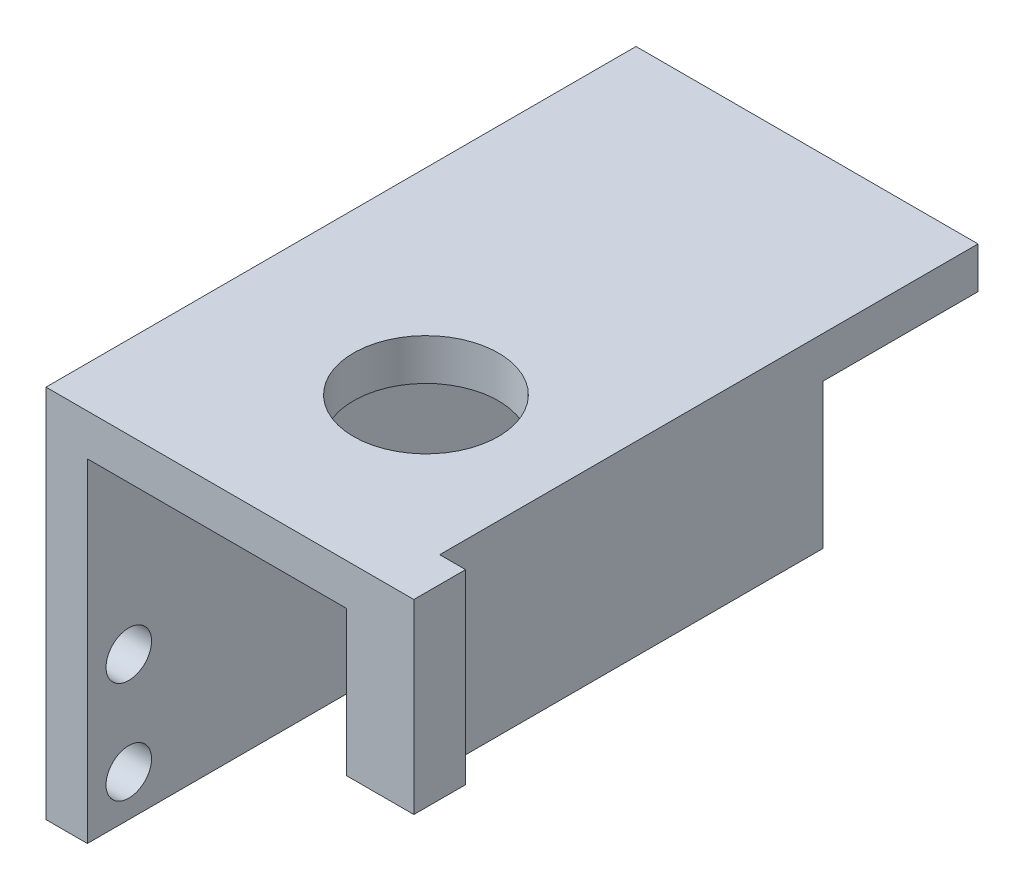
ISO-10303-21;
HEADER;
FILE_DESCRIPTION(('STEP AP214'),'2;1');
FILE_NAME('part.step','',(''),(''),'','','');
FILE_SCHEMA(('AUTOMOTIVE_DESIGN { 1 0 10303 214 1 1 1 1 }'));
ENDSEC;
DATA;
#1=APPLICATION_CONTEXT('core data for automotive mechanical design processes');
#2=APPLICATION_PROTOCOL_DEFINITION('international standard','automotive_design',2000,#1);
#3=PRODUCT_CONTEXT('',#1,'mechanical');
#4=PRODUCT('Part','Part','',(#3));
#5=PRODUCT_RELATED_PRODUCT_CATEGORY('part','',(#4));
#6=PRODUCT_DEFINITION_FORMATION('','',#4);
#7=PRODUCT_DEFINITION_CONTEXT('part definition',#1,'design');
#8=PRODUCT_DEFINITION('design','',#6,#7);
#9=PRODUCT_DEFINITION_SHAPE('','',#8);
#10=(LENGTH_UNIT() NAMED_UNIT(*) SI_UNIT(.MILLI.,.METRE.));
#11=(NAMED_UNIT(*) PLANE_ANGLE_UNIT() SI_UNIT($,.RADIAN.));
#12=(NAMED_UNIT(*) SI_UNIT($,.STERADIAN.) SOLID_ANGLE_UNIT());
#13=UNCERTAINTY_MEASURE_WITH_UNIT(LENGTH_MEASURE(1.E-05),#10,'distance_accuracy_value','');
#14=(GEOMETRIC_REPRESENTATION_CONTEXT(3) GLOBAL_UNCERTAINTY_ASSIGNED_CONTEXT((#13)) GLOBAL_UNIT_ASSIGNED_CONTEXT((#10,
#11,#12)) REPRESENTATION_CONTEXT('',''));
#15=CARTESIAN_POINT('',(0.,0.,0.));
#16=DIRECTION('',(0.,0.,1.));
#17=DIRECTION('',(1.,0.,0.));
#18=AXIS2_PLACEMENT_3D('',#15,#16,#17);
#19=CARTESIAN_POINT('',(33.05,14.1,28.51));
#20=DIRECTION('',(0.,1.,0.));
#21=DIRECTION('',(0.,0.,1.));
#22=AXIS2_PLACEMENT_3D('',#19,#20,#21);
#23=PLANE('',#22);
#24=CARTESIAN_POINT('',(19.,14.1,10.79));
#25=DIRECTION('',(0.,1.,0.));
#26=DIRECTION('',(0.,0.,1.));
#27=AXIS2_PLACEMENT_3D('',#24,#25,#26);
#28=CIRCLE('',#27,7.);
#29=CARTESIAN_POINT('',(19.,14.1,17.79));
#30=VERTEX_POINT('',#29);
#31=EDGE_CURVE('E172',#30,#30,#28,.F.);
#32=ORIENTED_EDGE('',*,*,#31,.F.);
#33=EDGE_LOOP('',(#32));
#34=FACE_BOUND('',#33,.T.);
#35=DIRECTION('',(0.,0.,-1.));
#36=VECTOR('',#35,1.);
#37=CARTESIAN_POINT('',(29.05,14.1,28.51));
#38=LINE('',#37,#36);
#39=CARTESIAN_POINT('',(29.05,14.1,28.51));
#40=VERTEX_POINT('',#39);
#41=CARTESIAN_POINT('',(29.05,14.1,-13.51));
#42=VERTEX_POINT('',#41);
#43=EDGE_CURVE('E176',#40,#42,#38,.T.);
#44=ORIENTED_EDGE('',*,*,#43,.F.);
#45=DIRECTION('',(-1.,0.,0.));
#46=VECTOR('',#45,1.);
#47=CARTESIAN_POINT('',(33.05,14.1,28.51));
#48=LINE('',#47,#46);
#49=CARTESIAN_POINT('',(4.,14.1,28.51));
#50=VERTEX_POINT('',#49);
#51=EDGE_CURVE('E215',#40,#50,#48,.T.);
#52=ORIENTED_EDGE('',*,*,#51,.T.);
#53=DIRECTION('',(0.,0.,-1.));
#54=VECTOR('',#53,1.);
#55=CARTESIAN_POINT('',(4.,14.1,28.51));
#56=LINE('',#55,#54);
#57=CARTESIAN_POINT('',(4.,14.1,-28.51));
#58=VERTEX_POINT('',#57);
#59=EDGE_CURVE('E197',#50,#58,#56,.T.);
#60=ORIENTED_EDGE('',*,*,#59,.T.);
#61=DIRECTION('',(-1.,0.,0.));
#62=VECTOR('',#61,1.);
#63=CARTESIAN_POINT('',(33.05,14.1,-28.51));
#64=LINE('',#63,#62);
#65=CARTESIAN_POINT('',(33.05,14.1,-28.51));
#66=VERTEX_POINT('',#65);
#67=EDGE_CURVE('E208',#66,#58,#64,.T.);
#68=ORIENTED_EDGE('',*,*,#67,.F.);
#69=DIRECTION('',(0.,0.,-1.));
#70=VECTOR('',#69,1.);
#71=CARTESIAN_POINT('',(33.05,14.1,28.51));
#72=LINE('',#71,#70);
#73=CARTESIAN_POINT('',(33.05,14.1,-13.51));
#74=VERTEX_POINT('',#73);
#75=EDGE_CURVE('E198',#74,#66,#72,.T.);
#76=ORIENTED_EDGE('',*,*,#75,.F.);
#77=DIRECTION('',(1.,0.,0.));
#78=VECTOR('',#77,1.);
#79=CARTESIAN_POINT('',(33.05,14.1,-13.51));
#80=LINE('',#79,#78);
#81=EDGE_CURVE('E178',#42,#74,#80,.T.);
#82=ORIENTED_EDGE('',*,*,#81,.F.);
#83=EDGE_LOOP('',(#44,#52,#60,#68,#76,#82));
#84=FACE_BOUND('',#83,.T.);
#85=ADVANCED_FACE('F41',(#34,#84),#23,.F.);
#86=CARTESIAN_POINT('',(4.,0.,0.));
#87=DIRECTION('',(1.,0.,0.));
#88=DIRECTION('',(0.,0.,-1.));
#89=AXIS2_PLACEMENT_3D('',#86,#87,#88);
#90=PLANE('',#89);
#91=ORIENTED_EDGE('',*,*,#59,.F.);
#92=DIRECTION('',(0.,-1.,0.));
#93=VECTOR('',#92,1.);
#94=CARTESIAN_POINT('',(4.,18.1,28.51));
#95=LINE('',#94,#93);
#96=CARTESIAN_POINT('',(4.,-18.1,28.51));
#97=VERTEX_POINT('',#96);
#98=EDGE_CURVE('E254',#50,#97,#95,.T.);
#99=ORIENTED_EDGE('',*,*,#98,.T.);
#100=DIRECTION('',(0.,0.,-1.));
#101=VECTOR('',#100,1.);
#102=CARTESIAN_POINT('',(4.,-18.1,28.51));
#103=LINE('',#102,#101);
#104=CARTESIAN_POINT('',(4.,-18.1,-28.51));
#105=VERTEX_POINT('',#104);
#106=EDGE_CURVE('E258',#97,#105,#103,.T.);
#107=ORIENTED_EDGE('',*,*,#106,.T.);
#108=DIRECTION('',(0.,1.,0.));
#109=VECTOR('',#108,1.);
#110=CARTESIAN_POINT('',(4.,18.1,-28.51));
#111=LINE('',#110,#109);
#112=EDGE_CURVE('E251',#105,#58,#111,.T.);
#113=ORIENTED_EDGE('',*,*,#112,.T.);
#114=EDGE_LOOP('',(#91,#99,#107,#113));
#115=FACE_BOUND('',#114,.T.);
#116=CARTESIAN_POINT('',(4.,-4.25,-24.51));
#117=DIRECTION('',(1.,0.,0.));
#118=DIRECTION('',(0.,0.,-1.));
#119=AXIS2_PLACEMENT_3D('',#116,#117,#118);
#120=CIRCLE('',#119,2.2);
#121=CARTESIAN_POINT('',(4.,-4.25,-26.71));
#122=VERTEX_POINT('',#121);
#123=EDGE_CURVE('E227',#122,#122,#120,.T.);
#124=ORIENTED_EDGE('',*,*,#123,.F.);
#125=EDGE_LOOP('',(#124));
#126=FACE_BOUND('',#125,.T.);
#127=CARTESIAN_POINT('',(4.,-4.25,24.51));
#128=DIRECTION('',(1.,0.,0.));
#129=DIRECTION('',(0.,0.,-1.));
#130=AXIS2_PLACEMENT_3D('',#127,#128,#129);
#131=CIRCLE('',#130,2.2);
#132=CARTESIAN_POINT('',(4.,-4.25,22.31));
#133=VERTEX_POINT('',#132);
#134=EDGE_CURVE('E243',#133,#133,#131,.T.);
#135=ORIENTED_EDGE('',*,*,#134,.F.);
#136=EDGE_LOOP('',(#135));
#137=FACE_BOUND('',#136,.T.);
#138=CARTESIAN_POINT('',(4.,-14.1,24.51));
#139=DIRECTION('',(1.,0.,0.));
#140=DIRECTION('',(0.,0.,-1.));
#141=AXIS2_PLACEMENT_3D('',#138,#139,#140);
#142=CIRCLE('',#141,2.2);
#143=CARTESIAN_POINT('',(4.,-14.1,22.31));
#144=VERTEX_POINT('',#143);
#145=EDGE_CURVE('E235',#144,#144,#142,.T.);
#146=ORIENTED_EDGE('',*,*,#145,.F.);
#147=EDGE_LOOP('',(#146));
#148=FACE_BOUND('',#147,.T.);
#149=CARTESIAN_POINT('',(4.,-14.1,-24.51));
#150=DIRECTION('',(1.,0.,0.));
#151=DIRECTION('',(0.,0.,-1.));
#152=AXIS2_PLACEMENT_3D('',#149,#150,#151);
#153=CIRCLE('',#152,2.2);
#154=CARTESIAN_POINT('',(4.,-14.1,-26.71));
#155=VERTEX_POINT('',#154);
#156=EDGE_CURVE('E219',#155,#155,#153,.T.);
#157=ORIENTED_EDGE('',*,*,#156,.F.);
#158=EDGE_LOOP('',(#157));
#159=FACE_BOUND('',#158,.T.);
#160=ADVANCED_FACE('F298',(#115,#126,#137,#148,#159),#90,.T.);
#161=CARTESIAN_POINT('',(0.,0.,0.));
#162=DIRECTION('',(1.,0.,0.));
#163=DIRECTION('',(0.,0.,-1.));
#164=AXIS2_PLACEMENT_3D('',#161,#162,#163);
#165=PLANE('',#164);
#166=DIRECTION('',(0.,1.,0.));
#167=VECTOR('',#166,1.);
#168=CARTESIAN_POINT('',(0.,18.1,-28.51));
#169=LINE('',#168,#167);
#170=CARTESIAN_POINT('',(0.,-18.1,-28.51));
#171=VERTEX_POINT('',#170);
#172=CARTESIAN_POINT('',(0.,18.1,-28.51));
#173=VERTEX_POINT('',#172);
#174=EDGE_CURVE('E247',#171,#173,#169,.T.);
#175=ORIENTED_EDGE('',*,*,#174,.F.);
#176=DIRECTION('',(0.,0.,-1.));
#177=VECTOR('',#176,1.);
#178=CARTESIAN_POINT('',(0.,-18.1,28.51));
#179=LINE('',#178,#177);
#180=CARTESIAN_POINT('',(0.,-18.1,28.51));
#181=VERTEX_POINT('',#180);
#182=EDGE_CURVE('E255',#181,#171,#179,.T.);
#183=ORIENTED_EDGE('',*,*,#182,.F.);
#184=DIRECTION('',(0.,-1.,0.));
#185=VECTOR('',#184,1.);
#186=CARTESIAN_POINT('',(0.,18.1,28.51));
#187=LINE('',#186,#185);
#188=CARTESIAN_POINT('',(0.,18.1,28.51));
#189=VERTEX_POINT('',#188);
#190=EDGE_CURVE('E268',#189,#181,#187,.T.);
#191=ORIENTED_EDGE('',*,*,#190,.F.);
#192=DIRECTION('',(0.,0.,1.));
#193=VECTOR('',#192,1.);
#194=CARTESIAN_POINT('',(0.,18.1,28.51));
#195=LINE('',#194,#193);
#196=EDGE_CURVE('E265',#173,#189,#195,.T.);
#197=ORIENTED_EDGE('',*,*,#196,.F.);
#198=EDGE_LOOP('',(#175,#183,#191,#197));
#199=FACE_BOUND('',#198,.T.);
#200=CARTESIAN_POINT('',(0.,-4.25,24.51));
#201=DIRECTION('',(1.,0.,0.));
#202=DIRECTION('',(0.,0.,-1.));
#203=AXIS2_PLACEMENT_3D('',#200,#201,#202);
#204=CIRCLE('',#203,2.2);
#205=CARTESIAN_POINT('',(0.,-4.25,22.31));
#206=VERTEX_POINT('',#205);
#207=EDGE_CURVE('E239',#206,#206,#204,.T.);
#208=ORIENTED_EDGE('',*,*,#207,.T.);
#209=EDGE_LOOP('',(#208));
#210=FACE_BOUND('',#209,.T.);
#211=CARTESIAN_POINT('',(0.,-14.1,24.51));
#212=DIRECTION('',(1.,0.,0.));
#213=DIRECTION('',(0.,0.,-1.));
#214=AXIS2_PLACEMENT_3D('',#211,#212,#213);
#215=CIRCLE('',#214,2.2);
#216=CARTESIAN_POINT('',(0.,-14.1,22.31));
#217=VERTEX_POINT('',#216);
#218=EDGE_CURVE('E231',#217,#217,#215,.T.);
#219=ORIENTED_EDGE('',*,*,#218,.T.);
#220=EDGE_LOOP('',(#219));
#221=FACE_BOUND('',#220,.T.);
#222=CARTESIAN_POINT('',(0.,-4.25,-24.51));
#223=DIRECTION('',(1.,0.,0.));
#224=DIRECTION('',(0.,0.,-1.));
#225=AXIS2_PLACEMENT_3D('',#222,#223,#224);
#226=CIRCLE('',#225,2.2);
#227=CARTESIAN_POINT('',(0.,-4.25,-26.71));
#228=VERTEX_POINT('',#227);
#229=EDGE_CURVE('E223',#228,#228,#226,.T.);
#230=ORIENTED_EDGE('',*,*,#229,.T.);
#231=EDGE_LOOP('',(#230));
#232=FACE_BOUND('',#231,.T.);
#233=CARTESIAN_POINT('',(0.,-14.1,-24.51));
#234=DIRECTION('',(1.,0.,0.));
#235=DIRECTION('',(0.,0.,-1.));
#236=AXIS2_PLACEMENT_3D('',#233,#234,#235);
#237=CIRCLE('',#236,2.2);
#238=CARTESIAN_POINT('',(0.,-14.1,-26.71));
#239=VERTEX_POINT('',#238);
#240=EDGE_CURVE('E218',#239,#239,#237,.T.);
#241=ORIENTED_EDGE('',*,*,#240,.T.);
#242=EDGE_LOOP('',(#241));
#243=FACE_BOUND('',#242,.T.);
#244=ADVANCED_FACE('F286',(#199,#210,#221,#232,#243),#165,.F.);
#245=CARTESIAN_POINT('',(4.,18.1,-28.51));
#246=DIRECTION('',(0.,0.,1.));
#247=DIRECTION('',(1.,0.,0.));
#248=AXIS2_PLACEMENT_3D('',#245,#246,#247);
#249=PLANE('',#248);
#250=ORIENTED_EDGE('',*,*,#174,.T.);
#251=DIRECTION('',(-1.,0.,0.));
#252=VECTOR('',#251,1.);
#253=CARTESIAN_POINT('',(4.,18.1,-28.51));
#254=LINE('',#253,#252);
#255=CARTESIAN_POINT('',(33.05,18.1,-28.51));
#256=VERTEX_POINT('',#255);
#257=EDGE_CURVE('E11',#256,#173,#254,.T.);
#258=ORIENTED_EDGE('',*,*,#257,.F.);
#259=DIRECTION('',(0.,1.,0.));
#260=VECTOR('',#259,1.);
#261=CARTESIAN_POINT('',(33.05,18.1,-28.51));
#262=LINE('',#261,#260);
#263=EDGE_CURVE('E201',#66,#256,#262,.T.);
#264=ORIENTED_EDGE('',*,*,#263,.F.);
#265=ORIENTED_EDGE('',*,*,#67,.T.);
#266=ORIENTED_EDGE('',*,*,#112,.F.);
#267=DIRECTION('',(-1.,0.,0.));
#268=VECTOR('',#267,1.);
#269=CARTESIAN_POINT('',(4.,-18.1,-28.51));
#270=LINE('',#269,#268);
#271=EDGE_CURVE('E261',#105,#171,#270,.T.);
#272=ORIENTED_EDGE('',*,*,#271,.T.);
#273=EDGE_LOOP('',(#250,#258,#264,#265,#266,#272));
#274=FACE_BOUND('',#273,.T.);
#275=ADVANCED_FACE('F43',(#274),#249,.F.);
#276=CARTESIAN_POINT('',(4.,18.1,28.51));
#277=DIRECTION('',(0.,-1.,0.));
#278=DIRECTION('',(0.,0.,-1.));
#279=AXIS2_PLACEMENT_3D('',#276,#277,#278);
#280=PLANE('',#279);
#281=CARTESIAN_POINT('',(19.,18.1,10.79));
#282=DIRECTION('',(0.,1.,0.));
#283=DIRECTION('',(0.,0.,1.));
#284=AXIS2_PLACEMENT_3D('',#281,#282,#283);
#285=CIRCLE('',#284,7.);
#286=CARTESIAN_POINT('',(19.,18.1,17.79));
#287=VERTEX_POINT('',#286);
#288=EDGE_CURVE('E168',#287,#287,#285,.T.);
#289=ORIENTED_EDGE('',*,*,#288,.F.);
#290=EDGE_LOOP('',(#289));
#291=FACE_BOUND('',#290,.T.);
#292=ORIENTED_EDGE('',*,*,#196,.T.);
#293=DIRECTION('',(-1.,0.,0.));
#294=VECTOR('',#293,1.);
#295=CARTESIAN_POINT('',(4.,18.1,28.51));
#296=LINE('',#295,#294);
#297=CARTESIAN_POINT('',(35.55,18.1,28.51));
#298=VERTEX_POINT('',#297);
#299=EDGE_CURVE('E50',#298,#189,#296,.T.);
#300=ORIENTED_EDGE('',*,*,#299,.F.);
#301=DIRECTION('',(0.,0.,1.));
#302=VECTOR('',#301,1.);
#303=CARTESIAN_POINT('',(35.55,18.1,28.51));
#304=LINE('',#303,#302);
#305=CARTESIAN_POINT('',(35.55,18.1,23.51));
#306=VERTEX_POINT('',#305);
#307=EDGE_CURVE('E152',#306,#298,#304,.T.);
#308=ORIENTED_EDGE('',*,*,#307,.F.);
#309=DIRECTION('',(-1.,0.,0.));
#310=VECTOR('',#309,1.);
#311=CARTESIAN_POINT('',(35.55,18.1,23.51));
#312=LINE('',#311,#310);
#313=CARTESIAN_POINT('',(33.05,18.1,23.51));
#314=VERTEX_POINT('',#313);
#315=EDGE_CURVE('E161',#306,#314,#312,.T.);
#316=ORIENTED_EDGE('',*,*,#315,.T.);
#317=DIRECTION('',(0.,0.,1.));
#318=VECTOR('',#317,1.);
#319=CARTESIAN_POINT('',(33.05,18.1,28.51));
#320=LINE('',#319,#318);
#321=EDGE_CURVE('E205',#256,#314,#320,.T.);
#322=ORIENTED_EDGE('',*,*,#321,.F.);
#323=ORIENTED_EDGE('',*,*,#257,.T.);
#324=EDGE_LOOP('',(#292,#300,#308,#316,#322,#323));
#325=FACE_BOUND('',#324,.T.);
#326=ADVANCED_FACE('F315',(#291,#325),#280,.F.);
#327=CARTESIAN_POINT('',(4.,18.1,28.51));
#328=DIRECTION('',(0.,0.,-1.));
#329=DIRECTION('',(0.,1.,0.));
#330=AXIS2_PLACEMENT_3D('',#327,#328,#329);
#331=PLANE('',#330);
#332=ORIENTED_EDGE('',*,*,#190,.T.);
#333=DIRECTION('',(-1.,0.,0.));
#334=VECTOR('',#333,1.);
#335=CARTESIAN_POINT('',(4.,-18.1,28.51));
#336=LINE('',#335,#334);
#337=EDGE_CURVE('E276',#97,#181,#336,.T.);
#338=ORIENTED_EDGE('',*,*,#337,.F.);
#339=ORIENTED_EDGE('',*,*,#98,.F.);
#340=ORIENTED_EDGE('',*,*,#51,.F.);
#341=DIRECTION('',(0.,1.,0.));
#342=VECTOR('',#341,1.);
#343=CARTESIAN_POINT('',(29.05,0.100000000000001,28.51));
#344=LINE('',#343,#342);
#345=CARTESIAN_POINT('',(29.05,0.100000000000001,28.51));
#346=VERTEX_POINT('',#345);
#347=EDGE_CURVE('E132',#346,#40,#344,.T.);
#348=ORIENTED_EDGE('',*,*,#347,.F.);
#349=DIRECTION('',(-1.,0.,0.));
#350=VECTOR('',#349,1.);
#351=CARTESIAN_POINT('',(33.05,0.100000000000001,28.51));
#352=LINE('',#351,#350);
#353=CARTESIAN_POINT('',(35.55,0.100000000000001,28.51));
#354=VERTEX_POINT('',#353);
#355=EDGE_CURVE('E125',#354,#346,#352,.T.);
#356=ORIENTED_EDGE('',*,*,#355,.F.);
#357=DIRECTION('',(0.,-1.,0.));
#358=VECTOR('',#357,1.);
#359=CARTESIAN_POINT('',(35.55,18.1,28.51));
#360=LINE('',#359,#358);
#361=EDGE_CURVE('E130',#298,#354,#360,.T.);
#362=ORIENTED_EDGE('',*,*,#361,.F.);
#363=ORIENTED_EDGE('',*,*,#299,.T.);
#364=EDGE_LOOP('',(#332,#338,#339,#340,#348,#356,#362,#363));
#365=FACE_BOUND('',#364,.T.);
#366=ADVANCED_FACE('F127',(#365),#331,.F.);
#367=CARTESIAN_POINT('',(4.,-18.1,28.51));
#368=DIRECTION('',(0.,1.,0.));
#369=DIRECTION('',(0.,0.,1.));
#370=AXIS2_PLACEMENT_3D('',#367,#368,#369);
#371=PLANE('',#370);
#372=ORIENTED_EDGE('',*,*,#182,.T.);
#373=ORIENTED_EDGE('',*,*,#271,.F.);
#374=ORIENTED_EDGE('',*,*,#106,.F.);
#375=ORIENTED_EDGE('',*,*,#337,.T.);
#376=EDGE_LOOP('',(#372,#373,#374,#375));
#377=FACE_BOUND('',#376,.T.);
#378=ADVANCED_FACE('F290',(#377),#371,.F.);
#379=CARTESIAN_POINT('',(4.,-4.25,24.51));
#380=DIRECTION('',(-1.,0.,0.));
#381=DIRECTION('',(0.,0.,1.));
#382=AXIS2_PLACEMENT_3D('',#379,#380,#381);
#383=CYLINDRICAL_SURFACE('',#382,2.2);
#384=ORIENTED_EDGE('',*,*,#134,.T.);
#385=EDGE_LOOP('',(#384));
#386=FACE_BOUND('',#385,.T.);
#387=ORIENTED_EDGE('',*,*,#207,.F.);
#388=EDGE_LOOP('',(#387));
#389=FACE_BOUND('',#388,.T.);
#390=ADVANCED_FACE('F347',(#386,#389),#383,.F.);
#391=CARTESIAN_POINT('',(4.,-14.1,24.51));
#392=DIRECTION('',(-1.,0.,0.));
#393=DIRECTION('',(0.,0.,1.));
#394=AXIS2_PLACEMENT_3D('',#391,#392,#393);
#395=CYLINDRICAL_SURFACE('',#394,2.2);
#396=ORIENTED_EDGE('',*,*,#145,.T.);
#397=EDGE_LOOP('',(#396));
#398=FACE_BOUND('',#397,.T.);
#399=ORIENTED_EDGE('',*,*,#218,.F.);
#400=EDGE_LOOP('',(#399));
#401=FACE_BOUND('',#400,.T.);
#402=ADVANCED_FACE('F343',(#398,#401),#395,.F.);
#403=CARTESIAN_POINT('',(4.,-4.25,-24.51));
#404=DIRECTION('',(-1.,0.,0.));
#405=DIRECTION('',(0.,0.,1.));
#406=AXIS2_PLACEMENT_3D('',#403,#404,#405);
#407=CYLINDRICAL_SURFACE('',#406,2.2);
#408=ORIENTED_EDGE('',*,*,#123,.T.);
#409=EDGE_LOOP('',(#408));
#410=FACE_BOUND('',#409,.T.);
#411=ORIENTED_EDGE('',*,*,#229,.F.);
#412=EDGE_LOOP('',(#411));
#413=FACE_BOUND('',#412,.T.);
#414=ADVANCED_FACE('F339',(#410,#413),#407,.F.);
#415=CARTESIAN_POINT('',(4.,-14.1,-24.51));
#416=DIRECTION('',(-1.,0.,0.));
#417=DIRECTION('',(0.,0.,1.));
#418=AXIS2_PLACEMENT_3D('',#415,#416,#417);
#419=CYLINDRICAL_SURFACE('',#418,2.2);
#420=ORIENTED_EDGE('',*,*,#156,.T.);
#421=EDGE_LOOP('',(#420));
#422=FACE_BOUND('',#421,.T.);
#423=ORIENTED_EDGE('',*,*,#240,.F.);
#424=EDGE_LOOP('',(#423));
#425=FACE_BOUND('',#424,.T.);
#426=ADVANCED_FACE('F336',(#422,#425),#419,.F.);
#427=CARTESIAN_POINT('',(33.05,0.,0.));
#428=DIRECTION('',(1.,0.,0.));
#429=DIRECTION('',(0.,0.,-1.));
#430=AXIS2_PLACEMENT_3D('',#427,#428,#429);
#431=PLANE('',#430);
#432=DIRECTION('',(0.,1.,0.));
#433=VECTOR('',#432,1.);
#434=CARTESIAN_POINT('',(33.05,18.1,23.51));
#435=LINE('',#434,#433);
#436=CARTESIAN_POINT('',(33.05,0.100000000000001,23.51));
#437=VERTEX_POINT('',#436);
#438=EDGE_CURVE('E57',#437,#314,#435,.T.);
#439=ORIENTED_EDGE('',*,*,#438,.F.);
#440=DIRECTION('',(0.,0.,1.));
#441=VECTOR('',#440,1.);
#442=CARTESIAN_POINT('',(33.05,0.100000000000001,28.51));
#443=LINE('',#442,#441);
#444=CARTESIAN_POINT('',(33.05,0.100000000000001,-13.51));
#445=VERTEX_POINT('',#444);
#446=EDGE_CURVE('E137',#445,#437,#443,.T.);
#447=ORIENTED_EDGE('',*,*,#446,.F.);
#448=DIRECTION('',(0.,1.,0.));
#449=VECTOR('',#448,1.);
#450=CARTESIAN_POINT('',(33.05,0.100000000000001,-13.51));
#451=LINE('',#450,#449);
#452=EDGE_CURVE('E63',#445,#74,#451,.T.);
#453=ORIENTED_EDGE('',*,*,#452,.T.);
#454=ORIENTED_EDGE('',*,*,#75,.T.);
#455=ORIENTED_EDGE('',*,*,#263,.T.);
#456=ORIENTED_EDGE('',*,*,#321,.T.);
#457=EDGE_LOOP('',(#439,#447,#453,#454,#455,#456));
#458=FACE_BOUND('',#457,.T.);
#459=ADVANCED_FACE('F334',(#458),#431,.T.);
#460=CARTESIAN_POINT('',(29.05,0.100000000000001,28.51));
#461=DIRECTION('',(1.,0.,0.));
#462=DIRECTION('',(0.,0.,-1.));
#463=AXIS2_PLACEMENT_3D('',#460,#461,#462);
#464=PLANE('',#463);
#465=ORIENTED_EDGE('',*,*,#43,.T.);
#466=DIRECTION('',(0.,1.,0.));
#467=VECTOR('',#466,1.);
#468=CARTESIAN_POINT('',(29.05,0.100000000000001,-13.51));
#469=LINE('',#468,#467);
#470=CARTESIAN_POINT('',(29.05,0.100000000000001,-13.51));
#471=VERTEX_POINT('',#470);
#472=EDGE_CURVE('E191',#471,#42,#469,.T.);
#473=ORIENTED_EDGE('',*,*,#472,.F.);
#474=DIRECTION('',(0.,0.,-1.));
#475=VECTOR('',#474,1.);
#476=CARTESIAN_POINT('',(29.05,0.100000000000001,28.51));
#477=LINE('',#476,#475);
#478=EDGE_CURVE('E136',#346,#471,#477,.T.);
#479=ORIENTED_EDGE('',*,*,#478,.F.);
#480=ORIENTED_EDGE('',*,*,#347,.T.);
#481=EDGE_LOOP('',(#465,#473,#479,#480));
#482=FACE_BOUND('',#481,.T.);
#483=ADVANCED_FACE('F307',(#482),#464,.F.);
#484=CARTESIAN_POINT('',(33.05,0.100000000000001,-13.51));
#485=DIRECTION('',(0.,0.,1.));
#486=DIRECTION('',(1.,0.,0.));
#487=AXIS2_PLACEMENT_3D('',#484,#485,#486);
#488=PLANE('',#487);
#489=ORIENTED_EDGE('',*,*,#81,.T.);
#490=ORIENTED_EDGE('',*,*,#452,.F.);
#491=DIRECTION('',(1.,0.,0.));
#492=VECTOR('',#491,1.);
#493=CARTESIAN_POINT('',(33.05,0.100000000000001,-13.51));
#494=LINE('',#493,#492);
#495=EDGE_CURVE('E182',#471,#445,#494,.T.);
#496=ORIENTED_EDGE('',*,*,#495,.F.);
#497=ORIENTED_EDGE('',*,*,#472,.T.);
#498=EDGE_LOOP('',(#489,#490,#496,#497));
#499=FACE_BOUND('',#498,.T.);
#500=ADVANCED_FACE('F310',(#499),#488,.F.);
#501=CARTESIAN_POINT('',(0.,0.100000000000001,0.));
#502=DIRECTION('',(0.,1.,0.));
#503=DIRECTION('',(0.,0.,1.));
#504=AXIS2_PLACEMENT_3D('',#501,#502,#503);
#505=PLANE('',#504);
#506=ORIENTED_EDGE('',*,*,#446,.T.);
#507=DIRECTION('',(-1.,0.,0.));
#508=VECTOR('',#507,1.);
#509=CARTESIAN_POINT('',(35.55,0.100000000000001,23.51));
#510=LINE('',#509,#508);
#511=CARTESIAN_POINT('',(35.55,0.100000000000001,23.51));
#512=VERTEX_POINT('',#511);
#513=EDGE_CURVE('E143',#512,#437,#510,.T.);
#514=ORIENTED_EDGE('',*,*,#513,.F.);
#515=DIRECTION('',(0.,0.,-1.));
#516=VECTOR('',#515,1.);
#517=CARTESIAN_POINT('',(35.55,0.100000000000001,28.51));
#518=LINE('',#517,#516);
#519=EDGE_CURVE('E140',#354,#512,#518,.T.);
#520=ORIENTED_EDGE('',*,*,#519,.F.);
#521=ORIENTED_EDGE('',*,*,#355,.T.);
#522=ORIENTED_EDGE('',*,*,#478,.T.);
#523=ORIENTED_EDGE('',*,*,#495,.T.);
#524=EDGE_LOOP('',(#506,#514,#520,#521,#522,#523));
#525=FACE_BOUND('',#524,.T.);
#526=ADVANCED_FACE('F141',(#525),#505,.F.);
#527=CARTESIAN_POINT('',(19.,-5.69898987322333,10.79));
#528=DIRECTION('',(0.,1.,0.));
#529=DIRECTION('',(0.,0.,1.));
#530=AXIS2_PLACEMENT_3D('',#527,#528,#529);
#531=CYLINDRICAL_SURFACE('',#530,7.);
#532=ORIENTED_EDGE('',*,*,#31,.T.);
#533=EDGE_LOOP('',(#532));
#534=FACE_BOUND('',#533,.T.);
#535=ORIENTED_EDGE('',*,*,#288,.T.);
#536=EDGE_LOOP('',(#535));
#537=FACE_BOUND('',#536,.T.);
#538=ADVANCED_FACE('F400',(#534,#537),#531,.F.);
#539=CARTESIAN_POINT('',(35.55,18.1,23.51));
#540=DIRECTION('',(0.,0.,1.));
#541=DIRECTION('',(0.,-1.,0.));
#542=AXIS2_PLACEMENT_3D('',#539,#540,#541);
#543=PLANE('',#542);
#544=ORIENTED_EDGE('',*,*,#438,.T.);
#545=ORIENTED_EDGE('',*,*,#315,.F.);
#546=DIRECTION('',(0.,1.,0.));
#547=VECTOR('',#546,1.);
#548=CARTESIAN_POINT('',(35.55,18.1,23.51));
#549=LINE('',#548,#547);
#550=EDGE_CURVE('E147',#512,#306,#549,.T.);
#551=ORIENTED_EDGE('',*,*,#550,.F.);
#552=ORIENTED_EDGE('',*,*,#513,.T.);
#553=EDGE_LOOP('',(#544,#545,#551,#552));
#554=FACE_BOUND('',#553,.T.);
#555=ADVANCED_FACE('F312',(#554),#543,.F.);
#556=CARTESIAN_POINT('',(35.55,0.,0.));
#557=DIRECTION('',(1.,0.,0.));
#558=DIRECTION('',(0.,0.,-1.));
#559=AXIS2_PLACEMENT_3D('',#556,#557,#558);
#560=PLANE('',#559);
#561=ORIENTED_EDGE('',*,*,#361,.T.);
#562=ORIENTED_EDGE('',*,*,#519,.T.);
#563=ORIENTED_EDGE('',*,*,#550,.T.);
#564=ORIENTED_EDGE('',*,*,#307,.T.);
#565=EDGE_LOOP('',(#561,#562,#563,#564));
#566=FACE_BOUND('',#565,.T.);
#567=ADVANCED_FACE('F150',(#566),#560,.T.);
#568=CLOSED_SHELL('',(#85,#160,#244,#275,#326,#366,#378,#390,#402,#414,#426,#459,#483,#500,#526,
#538,#555,#567));
#569=MANIFOLD_SOLID_BREP('B2',#568);
#570=ADVANCED_BREP_SHAPE_REPRESENTATION('',(#18,#569),#14);
#571=SHAPE_DEFINITION_REPRESENTATION(#9,#570);
ENDSEC;
END-ISO-10303-21;
